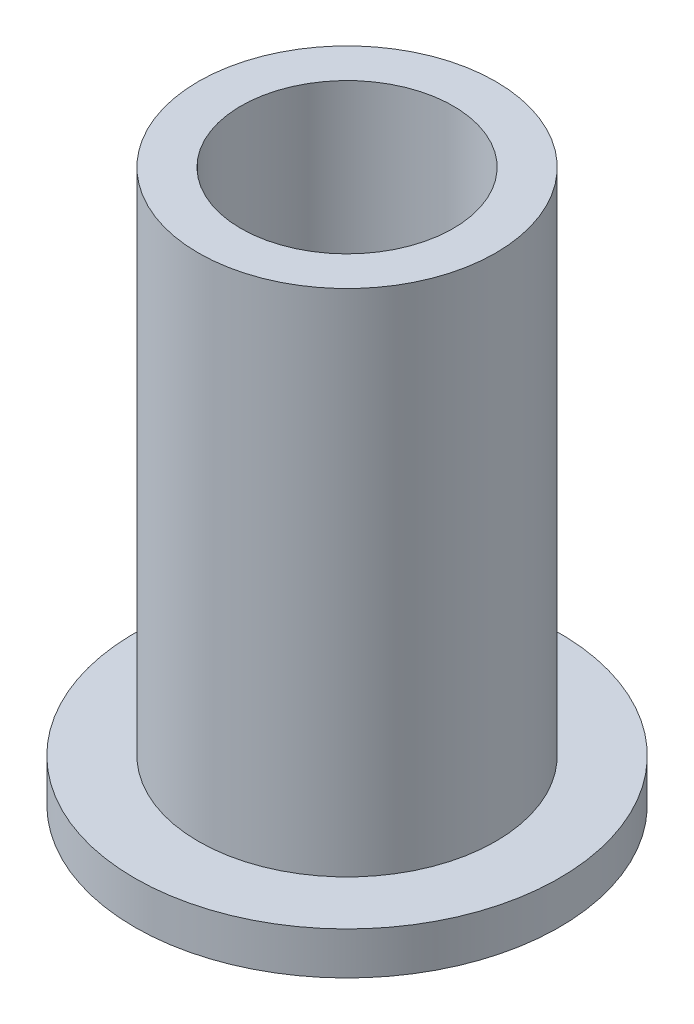
ISO-10303-21;
HEADER;
FILE_DESCRIPTION(('STEP AP214'),'2;1');
FILE_NAME('part.step','',(''),(''),'','','');
FILE_SCHEMA(('AUTOMOTIVE_DESIGN { 1 0 10303 214 1 1 1 1 }'));
ENDSEC;
DATA;
#1=APPLICATION_CONTEXT('core data for automotive mechanical design processes');
#2=APPLICATION_PROTOCOL_DEFINITION('international standard','automotive_design',2000,#1);
#3=PRODUCT_CONTEXT('',#1,'mechanical');
#4=PRODUCT('Part','Part','',(#3));
#5=PRODUCT_RELATED_PRODUCT_CATEGORY('part','',(#4));
#6=PRODUCT_DEFINITION_FORMATION('','',#4);
#7=PRODUCT_DEFINITION_CONTEXT('part definition',#1,'design');
#8=PRODUCT_DEFINITION('design','',#6,#7);
#9=PRODUCT_DEFINITION_SHAPE('','',#8);
#10=(LENGTH_UNIT() NAMED_UNIT(*) SI_UNIT(.MILLI.,.METRE.));
#11=(NAMED_UNIT(*) PLANE_ANGLE_UNIT() SI_UNIT($,.RADIAN.));
#12=(NAMED_UNIT(*) SI_UNIT($,.STERADIAN.) SOLID_ANGLE_UNIT());
#13=UNCERTAINTY_MEASURE_WITH_UNIT(LENGTH_MEASURE(1.E-05),#10,'distance_accuracy_value','');
#14=(GEOMETRIC_REPRESENTATION_CONTEXT(3) GLOBAL_UNCERTAINTY_ASSIGNED_CONTEXT((#13)) GLOBAL_UNIT_ASSIGNED_CONTEXT((#10,
#11,#12)) REPRESENTATION_CONTEXT('',''));
#15=CARTESIAN_POINT('',(0.,0.,0.));
#16=DIRECTION('',(0.,0.,1.));
#17=DIRECTION('',(1.,0.,0.));
#18=AXIS2_PLACEMENT_3D('',#15,#16,#17);
#19=CARTESIAN_POINT('',(0.,1.,0.));
#20=DIRECTION('',(0.,-1.,0.));
#21=DIRECTION('',(0.,0.,-1.));
#22=AXIS2_PLACEMENT_3D('',#19,#20,#21);
#23=CYLINDRICAL_SURFACE('',#22,5.);
#24=CARTESIAN_POINT('',(0.,1.,0.));
#25=DIRECTION('',(0.,1.,0.));
#26=DIRECTION('',(0.,0.,1.));
#27=AXIS2_PLACEMENT_3D('',#24,#25,#26);
#28=CIRCLE('',#27,5.);
#29=CARTESIAN_POINT('',(0.,1.,5.));
#30=VERTEX_POINT('',#29);
#31=EDGE_CURVE('E45',#30,#30,#28,.T.);
#32=ORIENTED_EDGE('',*,*,#31,.F.);
#33=EDGE_LOOP('',(#32));
#34=FACE_BOUND('',#33,.T.);
#35=CARTESIAN_POINT('',(0.,0.,0.));
#36=DIRECTION('',(0.,1.,0.));
#37=DIRECTION('',(0.,0.,1.));
#38=AXIS2_PLACEMENT_3D('',#35,#36,#37);
#39=CIRCLE('',#38,5.);
#40=CARTESIAN_POINT('',(0.,0.,5.));
#41=VERTEX_POINT('',#40);
#42=EDGE_CURVE('E40',#41,#41,#39,.T.);
#43=ORIENTED_EDGE('',*,*,#42,.T.);
#44=EDGE_LOOP('',(#43));
#45=FACE_BOUND('',#44,.T.);
#46=ADVANCED_FACE('F37',(#34,#45),#23,.T.);
#47=CARTESIAN_POINT('',(0.,1.,0.));
#48=DIRECTION('',(0.,1.,0.));
#49=DIRECTION('',(0.,0.,1.));
#50=AXIS2_PLACEMENT_3D('',#47,#48,#49);
#51=PLANE('',#50);
#52=CARTESIAN_POINT('',(0.,1.,0.));
#53=DIRECTION('',(0.,1.,0.));
#54=DIRECTION('',(0.,0.,1.));
#55=AXIS2_PLACEMENT_3D('',#52,#53,#54);
#56=CIRCLE('',#55,3.5);
#57=CARTESIAN_POINT('',(0.,1.,3.5));
#58=VERTEX_POINT('',#57);
#59=EDGE_CURVE('E10',#58,#58,#56,.T.);
#60=ORIENTED_EDGE('',*,*,#59,.F.);
#61=EDGE_LOOP('',(#60));
#62=FACE_BOUND('',#61,.T.);
#63=ORIENTED_EDGE('',*,*,#31,.T.);
#64=EDGE_LOOP('',(#63));
#65=FACE_BOUND('',#64,.T.);
#66=ADVANCED_FACE('F80',(#62,#65),#51,.T.);
#67=CARTESIAN_POINT('',(0.,0.,0.));
#68=DIRECTION('',(0.,1.,0.));
#69=DIRECTION('',(0.,0.,1.));
#70=AXIS2_PLACEMENT_3D('',#67,#68,#69);
#71=PLANE('',#70);
#72=CARTESIAN_POINT('',(0.,0.,0.));
#73=DIRECTION('',(0.,1.,0.));
#74=DIRECTION('',(0.,0.,1.));
#75=AXIS2_PLACEMENT_3D('',#72,#73,#74);
#76=CIRCLE('',#75,2.5);
#77=CARTESIAN_POINT('',(0.,0.,2.5));
#78=VERTEX_POINT('',#77);
#79=EDGE_CURVE('E56',#78,#78,#76,.F.);
#80=ORIENTED_EDGE('',*,*,#79,.F.);
#81=EDGE_LOOP('',(#80));
#82=FACE_BOUND('',#81,.T.);
#83=ORIENTED_EDGE('',*,*,#42,.F.);
#84=EDGE_LOOP('',(#83));
#85=FACE_BOUND('',#84,.T.);
#86=ADVANCED_FACE('F75',(#82,#85),#71,.F.);
#87=CARTESIAN_POINT('',(0.,13.,0.));
#88=DIRECTION('',(0.,-1.,0.));
#89=DIRECTION('',(0.,0.,-1.));
#90=AXIS2_PLACEMENT_3D('',#87,#88,#89);
#91=CYLINDRICAL_SURFACE('',#90,3.5);
#92=CARTESIAN_POINT('',(0.,13.,0.));
#93=DIRECTION('',(0.,1.,0.));
#94=DIRECTION('',(0.,0.,1.));
#95=AXIS2_PLACEMENT_3D('',#92,#93,#94);
#96=CIRCLE('',#95,3.5);
#97=CARTESIAN_POINT('',(0.,13.,3.5));
#98=VERTEX_POINT('',#97);
#99=EDGE_CURVE('E52',#98,#98,#96,.T.);
#100=ORIENTED_EDGE('',*,*,#99,.F.);
#101=EDGE_LOOP('',(#100));
#102=FACE_BOUND('',#101,.T.);
#103=ORIENTED_EDGE('',*,*,#59,.T.);
#104=EDGE_LOOP('',(#103));
#105=FACE_BOUND('',#104,.T.);
#106=ADVANCED_FACE('F70',(#102,#105),#91,.T.);
#107=CARTESIAN_POINT('',(0.,13.,0.));
#108=DIRECTION('',(0.,1.,0.));
#109=DIRECTION('',(0.,0.,1.));
#110=AXIS2_PLACEMENT_3D('',#107,#108,#109);
#111=PLANE('',#110);
#112=CARTESIAN_POINT('',(0.,13.,0.));
#113=DIRECTION('',(0.,1.,0.));
#114=DIRECTION('',(0.,0.,1.));
#115=AXIS2_PLACEMENT_3D('',#112,#113,#114);
#116=CIRCLE('',#115,2.5);
#117=CARTESIAN_POINT('',(0.,13.,2.5));
#118=VERTEX_POINT('',#117);
#119=EDGE_CURVE('E60',#118,#118,#116,.T.);
#120=ORIENTED_EDGE('',*,*,#119,.F.);
#121=EDGE_LOOP('',(#120));
#122=FACE_BOUND('',#121,.T.);
#123=ORIENTED_EDGE('',*,*,#99,.T.);
#124=EDGE_LOOP('',(#123));
#125=FACE_BOUND('',#124,.T.);
#126=ADVANCED_FACE('F67',(#122,#125),#111,.T.);
#127=CARTESIAN_POINT('',(0.,-7.07106781186548,0.));
#128=DIRECTION('',(0.,1.,0.));
#129=DIRECTION('',(0.,0.,1.));
#130=AXIS2_PLACEMENT_3D('',#127,#128,#129);
#131=CYLINDRICAL_SURFACE('',#130,2.5);
#132=ORIENTED_EDGE('',*,*,#79,.T.);
#133=EDGE_LOOP('',(#132));
#134=FACE_BOUND('',#133,.T.);
#135=ORIENTED_EDGE('',*,*,#119,.T.);
#136=EDGE_LOOP('',(#135));
#137=FACE_BOUND('',#136,.T.);
#138=ADVANCED_FACE('F65',(#134,#137),#131,.F.);
#139=CLOSED_SHELL('',(#46,#66,#86,#106,#126,#138));
#140=MANIFOLD_SOLID_BREP('B2',#139);
#141=ADVANCED_BREP_SHAPE_REPRESENTATION('',(#18,#140),#14);
#142=SHAPE_DEFINITION_REPRESENTATION(#9,#141);
ENDSEC;
END-ISO-10303-21;
